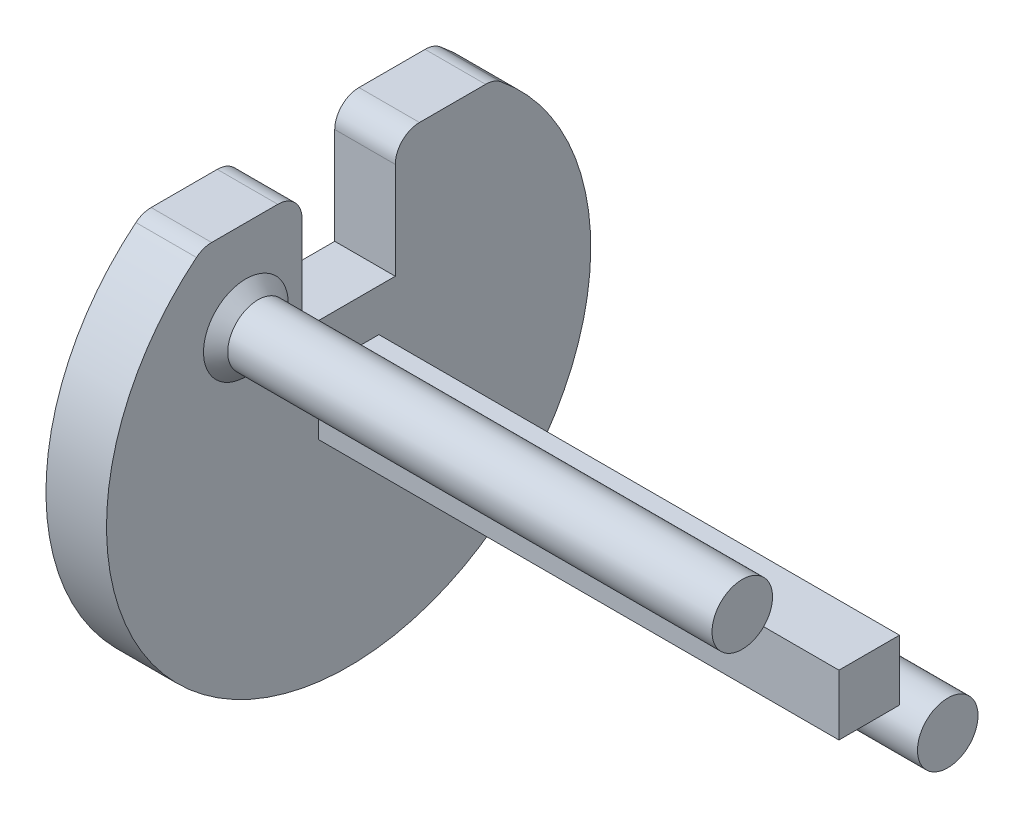
ISO-10303-21;
HEADER;
FILE_DESCRIPTION(('STEP AP214'),'2;1');
FILE_NAME('part.step','',(''),(''),'','','');
FILE_SCHEMA(('AUTOMOTIVE_DESIGN { 1 0 10303 214 1 1 1 1 }'));
ENDSEC;
DATA;
#1=APPLICATION_CONTEXT('core data for automotive mechanical design processes');
#2=APPLICATION_PROTOCOL_DEFINITION('international standard','automotive_design',2000,#1);
#3=PRODUCT_CONTEXT('',#1,'mechanical');
#4=PRODUCT('Part','Part','',(#3));
#5=PRODUCT_RELATED_PRODUCT_CATEGORY('part','',(#4));
#6=PRODUCT_DEFINITION_FORMATION('','',#4);
#7=PRODUCT_DEFINITION_CONTEXT('part definition',#1,'design');
#8=PRODUCT_DEFINITION('design','',#6,#7);
#9=PRODUCT_DEFINITION_SHAPE('','',#8);
#10=(LENGTH_UNIT() NAMED_UNIT(*) SI_UNIT(.MILLI.,.METRE.));
#11=(NAMED_UNIT(*) PLANE_ANGLE_UNIT() SI_UNIT($,.RADIAN.));
#12=(NAMED_UNIT(*) SI_UNIT($,.STERADIAN.) SOLID_ANGLE_UNIT());
#13=UNCERTAINTY_MEASURE_WITH_UNIT(LENGTH_MEASURE(1.E-05),#10,'distance_accuracy_value','');
#14=(GEOMETRIC_REPRESENTATION_CONTEXT(3) GLOBAL_UNCERTAINTY_ASSIGNED_CONTEXT((#13)) GLOBAL_UNIT_ASSIGNED_CONTEXT((#10,
#11,#12)) REPRESENTATION_CONTEXT('',''));
#15=CARTESIAN_POINT('',(0.,0.,0.));
#16=DIRECTION('',(0.,0.,1.));
#17=DIRECTION('',(1.,0.,0.));
#18=AXIS2_PLACEMENT_3D('',#15,#16,#17);
#19=CARTESIAN_POINT('',(5.,0.,0.));
#20=DIRECTION('',(1.,0.,0.));
#21=DIRECTION('',(0.,0.,-1.));
#22=AXIS2_PLACEMENT_3D('',#19,#20,#21);
#23=PLANE('',#22);
#24=CARTESIAN_POINT('',(5.,-8.48528137423855,-8.48528137423859));
#25=DIRECTION('',(1.,0.,0.));
#26=DIRECTION('',(0.,0.,-1.));
#27=AXIS2_PLACEMENT_3D('',#24,#25,#26);
#28=CIRCLE('',#27,3.49999999999999);
#29=CARTESIAN_POINT('',(5.,-8.48528137423855,-11.9852813742386));
#30=VERTEX_POINT('',#29);
#31=EDGE_CURVE('E53',#30,#30,#28,.F.);
#32=ORIENTED_EDGE('',*,*,#31,.T.);
#33=EDGE_LOOP('',(#32));
#34=FACE_BOUND('',#33,.T.);
#35=CARTESIAN_POINT('',(5.,8.48528137423856,8.48528137423858));
#36=DIRECTION('',(1.,0.,0.));
#37=DIRECTION('',(0.,0.,-1.));
#38=AXIS2_PLACEMENT_3D('',#35,#36,#37);
#39=CIRCLE('',#38,3.49999999999999);
#40=CARTESIAN_POINT('',(5.,8.48528137423856,4.98528137423859));
#41=VERTEX_POINT('',#40);
#42=EDGE_CURVE('E311',#41,#41,#39,.F.);
#43=ORIENTED_EDGE('',*,*,#42,.T.);
#44=EDGE_LOOP('',(#43));
#45=FACE_BOUND('',#44,.T.);
#46=CARTESIAN_POINT('',(5.,0.,0.));
#47=DIRECTION('',(1.,0.,0.));
#48=DIRECTION('',(0.,0.,-1.));
#49=AXIS2_PLACEMENT_3D('',#46,#47,#48);
#50=CIRCLE('',#49,20.);
#51=CARTESIAN_POINT('',(5.,15.5555555555556,12.5707872210942));
#52=VERTEX_POINT('',#51);
#53=CARTESIAN_POINT('',(5.,15.5555555555556,-12.5707872210942));
#54=VERTEX_POINT('',#53);
#55=EDGE_CURVE('E251',#52,#54,#50,.T.);
#56=ORIENTED_EDGE('',*,*,#55,.T.);
#57=CARTESIAN_POINT('',(5.,14.,-11.3137084989848));
#58=DIRECTION('',(1.,0.,0.));
#59=DIRECTION('',(0.,0.,-1.));
#60=AXIS2_PLACEMENT_3D('',#57,#58,#59);
#61=CIRCLE('',#60,2.);
#62=CARTESIAN_POINT('',(5.,16.,-11.3137084989848));
#63=VERTEX_POINT('',#62);
#64=EDGE_CURVE('E274',#54,#63,#61,.T.);
#65=ORIENTED_EDGE('',*,*,#64,.T.);
#66=DIRECTION('',(0.,0.,-1.));
#67=VECTOR('',#66,1.);
#68=CARTESIAN_POINT('',(5.,16.,0.));
#69=LINE('',#68,#67);
#70=CARTESIAN_POINT('',(5.,16.,-5.85234209844043));
#71=VERTEX_POINT('',#70);
#72=EDGE_CURVE('E177',#71,#63,#69,.T.);
#73=ORIENTED_EDGE('',*,*,#72,.F.);
#74=CARTESIAN_POINT('',(5.,14.,-5.85234209844043));
#75=DIRECTION('',(1.,0.,0.));
#76=DIRECTION('',(0.,0.,-1.));
#77=AXIS2_PLACEMENT_3D('',#74,#75,#76);
#78=CIRCLE('',#77,2.);
#79=CARTESIAN_POINT('',(5.,14.,-3.85234209844043));
#80=VERTEX_POINT('',#79);
#81=EDGE_CURVE('E271',#71,#80,#78,.T.);
#82=ORIENTED_EDGE('',*,*,#81,.T.);
#83=DIRECTION('',(0.,1.,0.));
#84=VECTOR('',#83,1.);
#85=CARTESIAN_POINT('',(5.,0.,-3.85234209844043));
#86=LINE('',#85,#84);
#87=CARTESIAN_POINT('',(5.,6.,-3.85234209844043));
#88=VERTEX_POINT('',#87);
#89=EDGE_CURVE('E192',#88,#80,#86,.T.);
#90=ORIENTED_EDGE('',*,*,#89,.F.);
#91=DIRECTION('',(0.,0.,-1.));
#92=VECTOR('',#91,1.);
#93=CARTESIAN_POINT('',(5.,6.,0.));
#94=LINE('',#93,#92);
#95=CARTESIAN_POINT('',(5.,6.,3.85234209844043));
#96=VERTEX_POINT('',#95);
#97=EDGE_CURVE('E189',#96,#88,#94,.T.);
#98=ORIENTED_EDGE('',*,*,#97,.F.);
#99=DIRECTION('',(0.,1.,0.));
#100=VECTOR('',#99,1.);
#101=CARTESIAN_POINT('',(5.,0.,3.85234209844043));
#102=LINE('',#101,#100);
#103=CARTESIAN_POINT('',(5.,14.,3.85234209844043));
#104=VERTEX_POINT('',#103);
#105=EDGE_CURVE('E155',#96,#104,#102,.T.);
#106=ORIENTED_EDGE('',*,*,#105,.T.);
#107=CARTESIAN_POINT('',(5.,14.,5.85234209844043));
#108=DIRECTION('',(1.,0.,0.));
#109=DIRECTION('',(0.,0.,-1.));
#110=AXIS2_PLACEMENT_3D('',#107,#108,#109);
#111=CIRCLE('',#110,2.);
#112=CARTESIAN_POINT('',(5.,16.,5.85234209844043));
#113=VERTEX_POINT('',#112);
#114=EDGE_CURVE('E268',#104,#113,#111,.T.);
#115=ORIENTED_EDGE('',*,*,#114,.T.);
#116=DIRECTION('',(0.,0.,-1.));
#117=VECTOR('',#116,1.);
#118=CARTESIAN_POINT('',(5.,16.,0.));
#119=LINE('',#118,#117);
#120=CARTESIAN_POINT('',(5.,16.,11.3137084989848));
#121=VERTEX_POINT('',#120);
#122=EDGE_CURVE('E184',#121,#113,#119,.T.);
#123=ORIENTED_EDGE('',*,*,#122,.F.);
#124=CARTESIAN_POINT('',(5.,14.,11.3137084989848));
#125=DIRECTION('',(1.,0.,0.));
#126=DIRECTION('',(0.,0.,-1.));
#127=AXIS2_PLACEMENT_3D('',#124,#125,#126);
#128=CIRCLE('',#127,2.);
#129=EDGE_CURVE('E265',#121,#52,#128,.T.);
#130=ORIENTED_EDGE('',*,*,#129,.T.);
#131=EDGE_LOOP('',(#56,#65,#73,#82,#90,#98,#106,#115,#123,#130));
#132=FACE_BOUND('',#131,.T.);
#133=DIRECTION('',(0.,0.,1.));
#134=VECTOR('',#133,1.);
#135=CARTESIAN_POINT('',(5.,2.5,2.5));
#136=LINE('',#135,#134);
#137=CARTESIAN_POINT('',(5.,2.5,-2.5));
#138=VERTEX_POINT('',#137);
#139=CARTESIAN_POINT('',(5.,2.5,2.5));
#140=VERTEX_POINT('',#139);
#141=EDGE_CURVE('E228',#138,#140,#136,.T.);
#142=ORIENTED_EDGE('',*,*,#141,.F.);
#143=DIRECTION('',(0.,1.,0.));
#144=VECTOR('',#143,1.);
#145=CARTESIAN_POINT('',(5.,-2.5,-2.5));
#146=LINE('',#145,#144);
#147=CARTESIAN_POINT('',(5.,-2.5,-2.5));
#148=VERTEX_POINT('',#147);
#149=EDGE_CURVE('E209',#148,#138,#146,.T.);
#150=ORIENTED_EDGE('',*,*,#149,.F.);
#151=DIRECTION('',(0.,0.,-1.));
#152=VECTOR('',#151,1.);
#153=CARTESIAN_POINT('',(5.,-2.5,2.5));
#154=LINE('',#153,#152);
#155=CARTESIAN_POINT('',(5.,-2.5,2.5));
#156=VERTEX_POINT('',#155);
#157=EDGE_CURVE('E215',#156,#148,#154,.T.);
#158=ORIENTED_EDGE('',*,*,#157,.F.);
#159=DIRECTION('',(0.,-1.,0.));
#160=VECTOR('',#159,1.);
#161=CARTESIAN_POINT('',(5.,-2.5,2.5));
#162=LINE('',#161,#160);
#163=EDGE_CURVE('E231',#140,#156,#162,.T.);
#164=ORIENTED_EDGE('',*,*,#163,.F.);
#165=EDGE_LOOP('',(#142,#150,#158,#164));
#166=FACE_BOUND('',#165,.T.);
#167=ADVANCED_FACE('F43',(#34,#45,#132,#166),#23,.T.);
#168=CARTESIAN_POINT('',(5.,0.,0.));
#169=DIRECTION('',(-1.,0.,0.));
#170=DIRECTION('',(0.,0.,1.));
#171=AXIS2_PLACEMENT_3D('',#168,#169,#170);
#172=CYLINDRICAL_SURFACE('',#171,20.);
#173=CARTESIAN_POINT('',(0.,0.,0.));
#174=DIRECTION('',(1.,0.,0.));
#175=DIRECTION('',(0.,0.,-1.));
#176=AXIS2_PLACEMENT_3D('',#173,#174,#175);
#177=CIRCLE('',#176,20.);
#178=CARTESIAN_POINT('',(0.,15.5555555555556,12.5707872210942));
#179=VERTEX_POINT('',#178);
#180=CARTESIAN_POINT('',(0.,15.5555555555556,-12.5707872210942));
#181=VERTEX_POINT('',#180);
#182=EDGE_CURVE('E250',#179,#181,#177,.T.);
#183=ORIENTED_EDGE('',*,*,#182,.T.);
#184=DIRECTION('',(-1.,0.,0.));
#185=VECTOR('',#184,1.);
#186=CARTESIAN_POINT('',(5.,15.5555555555556,-12.5707872210942));
#187=LINE('',#186,#185);
#188=EDGE_CURVE('E261',#181,#54,#187,.F.);
#189=ORIENTED_EDGE('',*,*,#188,.T.);
#190=ORIENTED_EDGE('',*,*,#55,.F.);
#191=DIRECTION('',(-1.,0.,0.));
#192=VECTOR('',#191,1.);
#193=CARTESIAN_POINT('',(5.,15.5555555555556,12.5707872210942));
#194=LINE('',#193,#192);
#195=EDGE_CURVE('E255',#52,#179,#194,.T.);
#196=ORIENTED_EDGE('',*,*,#195,.T.);
#197=EDGE_LOOP('',(#183,#189,#190,#196));
#198=FACE_BOUND('',#197,.T.);
#199=ADVANCED_FACE('F345',(#198),#172,.T.);
#200=CARTESIAN_POINT('',(0.,0.,0.));
#201=DIRECTION('',(1.,0.,0.));
#202=DIRECTION('',(0.,0.,-1.));
#203=AXIS2_PLACEMENT_3D('',#200,#201,#202);
#204=PLANE('',#203);
#205=DIRECTION('',(0.,0.,-1.));
#206=VECTOR('',#205,1.);
#207=CARTESIAN_POINT('',(0.,16.,0.));
#208=LINE('',#207,#206);
#209=CARTESIAN_POINT('',(0.,16.,-5.85234209844043));
#210=VERTEX_POINT('',#209);
#211=CARTESIAN_POINT('',(0.,16.,-11.3137084989848));
#212=VERTEX_POINT('',#211);
#213=EDGE_CURVE('E161',#210,#212,#208,.T.);
#214=ORIENTED_EDGE('',*,*,#213,.T.);
#215=CARTESIAN_POINT('',(0.,14.,-11.3137084989848));
#216=DIRECTION('',(1.,0.,0.));
#217=DIRECTION('',(0.,0.,-1.));
#218=AXIS2_PLACEMENT_3D('',#215,#216,#217);
#219=CIRCLE('',#218,2.);
#220=EDGE_CURVE('E292',#212,#181,#219,.F.);
#221=ORIENTED_EDGE('',*,*,#220,.T.);
#222=ORIENTED_EDGE('',*,*,#182,.F.);
#223=CARTESIAN_POINT('',(0.,14.,11.3137084989848));
#224=DIRECTION('',(1.,0.,0.));
#225=DIRECTION('',(0.,0.,-1.));
#226=AXIS2_PLACEMENT_3D('',#223,#224,#225);
#227=CIRCLE('',#226,2.);
#228=CARTESIAN_POINT('',(0.,16.,11.3137084989848));
#229=VERTEX_POINT('',#228);
#230=EDGE_CURVE('E284',#179,#229,#227,.F.);
#231=ORIENTED_EDGE('',*,*,#230,.T.);
#232=DIRECTION('',(0.,0.,-1.));
#233=VECTOR('',#232,1.);
#234=CARTESIAN_POINT('',(0.,16.,0.));
#235=LINE('',#234,#233);
#236=CARTESIAN_POINT('',(0.,16.,5.85234209844043));
#237=VERTEX_POINT('',#236);
#238=EDGE_CURVE('E174',#229,#237,#235,.T.);
#239=ORIENTED_EDGE('',*,*,#238,.T.);
#240=CARTESIAN_POINT('',(0.,14.,5.85234209844043));
#241=DIRECTION('',(1.,0.,0.));
#242=DIRECTION('',(0.,0.,-1.));
#243=AXIS2_PLACEMENT_3D('',#240,#241,#242);
#244=CIRCLE('',#243,2.);
#245=CARTESIAN_POINT('',(0.,14.,3.85234209844043));
#246=VERTEX_POINT('',#245);
#247=EDGE_CURVE('E60',#237,#246,#244,.F.);
#248=ORIENTED_EDGE('',*,*,#247,.T.);
#249=DIRECTION('',(0.,1.,0.));
#250=VECTOR('',#249,1.);
#251=CARTESIAN_POINT('',(0.,0.,3.85234209844043));
#252=LINE('',#251,#250);
#253=CARTESIAN_POINT('',(0.,6.,3.85234209844043));
#254=VERTEX_POINT('',#253);
#255=EDGE_CURVE('E152',#254,#246,#252,.T.);
#256=ORIENTED_EDGE('',*,*,#255,.F.);
#257=DIRECTION('',(0.,0.,-1.));
#258=VECTOR('',#257,1.);
#259=CARTESIAN_POINT('',(0.,6.,0.));
#260=LINE('',#259,#258);
#261=CARTESIAN_POINT('',(0.,6.,-3.85234209844043));
#262=VERTEX_POINT('',#261);
#263=EDGE_CURVE('E164',#254,#262,#260,.T.);
#264=ORIENTED_EDGE('',*,*,#263,.T.);
#265=DIRECTION('',(0.,1.,0.));
#266=VECTOR('',#265,1.);
#267=CARTESIAN_POINT('',(0.,0.,-3.85234209844043));
#268=LINE('',#267,#266);
#269=CARTESIAN_POINT('',(0.,14.,-3.85234209844043));
#270=VERTEX_POINT('',#269);
#271=EDGE_CURVE('E169',#262,#270,#268,.T.);
#272=ORIENTED_EDGE('',*,*,#271,.T.);
#273=CARTESIAN_POINT('',(0.,14.,-5.85234209844043));
#274=DIRECTION('',(1.,0.,0.));
#275=DIRECTION('',(0.,0.,-1.));
#276=AXIS2_PLACEMENT_3D('',#273,#274,#275);
#277=CIRCLE('',#276,2.);
#278=EDGE_CURVE('E289',#270,#210,#277,.F.);
#279=ORIENTED_EDGE('',*,*,#278,.T.);
#280=EDGE_LOOP('',(#214,#221,#222,#231,#239,#248,#256,#264,#272,#279));
#281=FACE_BOUND('',#280,.T.);
#282=ADVANCED_FACE('F172',(#281),#204,.F.);
#283=CARTESIAN_POINT('',(48.,-2.5,-2.5));
#284=DIRECTION('',(0.,0.,1.));
#285=DIRECTION('',(1.,0.,0.));
#286=AXIS2_PLACEMENT_3D('',#283,#284,#285);
#287=PLANE('',#286);
#288=ORIENTED_EDGE('',*,*,#149,.T.);
#289=DIRECTION('',(-1.,0.,0.));
#290=VECTOR('',#289,1.);
#291=CARTESIAN_POINT('',(48.,2.5,-2.5));
#292=LINE('',#291,#290);
#293=CARTESIAN_POINT('',(48.,2.5,-2.5));
#294=VERTEX_POINT('',#293);
#295=EDGE_CURVE('E247',#294,#138,#292,.T.);
#296=ORIENTED_EDGE('',*,*,#295,.F.);
#297=DIRECTION('',(0.,1.,0.));
#298=VECTOR('',#297,1.);
#299=CARTESIAN_POINT('',(48.,-2.5,-2.5));
#300=LINE('',#299,#298);
#301=CARTESIAN_POINT('',(48.,-2.5,-2.5));
#302=VERTEX_POINT('',#301);
#303=EDGE_CURVE('E210',#302,#294,#300,.T.);
#304=ORIENTED_EDGE('',*,*,#303,.F.);
#305=DIRECTION('',(-1.,0.,0.));
#306=VECTOR('',#305,1.);
#307=CARTESIAN_POINT('',(48.,-2.5,-2.5));
#308=LINE('',#307,#306);
#309=EDGE_CURVE('E224',#302,#148,#308,.T.);
#310=ORIENTED_EDGE('',*,*,#309,.T.);
#311=EDGE_LOOP('',(#288,#296,#304,#310));
#312=FACE_BOUND('',#311,.T.);
#313=ADVANCED_FACE('F356',(#312),#287,.F.);
#314=CARTESIAN_POINT('',(48.,2.5,2.5));
#315=DIRECTION('',(0.,-1.,0.));
#316=DIRECTION('',(0.,0.,-1.));
#317=AXIS2_PLACEMENT_3D('',#314,#315,#316);
#318=PLANE('',#317);
#319=ORIENTED_EDGE('',*,*,#141,.T.);
#320=DIRECTION('',(-1.,0.,0.));
#321=VECTOR('',#320,1.);
#322=CARTESIAN_POINT('',(48.,2.5,2.5));
#323=LINE('',#322,#321);
#324=CARTESIAN_POINT('',(48.,2.5,2.5));
#325=VERTEX_POINT('',#324);
#326=EDGE_CURVE('E243',#325,#140,#323,.T.);
#327=ORIENTED_EDGE('',*,*,#326,.F.);
#328=DIRECTION('',(0.,0.,1.));
#329=VECTOR('',#328,1.);
#330=CARTESIAN_POINT('',(48.,2.5,2.5));
#331=LINE('',#330,#329);
#332=EDGE_CURVE('E214',#294,#325,#331,.T.);
#333=ORIENTED_EDGE('',*,*,#332,.F.);
#334=ORIENTED_EDGE('',*,*,#295,.T.);
#335=EDGE_LOOP('',(#319,#327,#333,#334));
#336=FACE_BOUND('',#335,.T.);
#337=ADVANCED_FACE('F472',(#336),#318,.F.);
#338=CARTESIAN_POINT('',(48.,-2.5,2.5));
#339=DIRECTION('',(0.,0.,-1.));
#340=DIRECTION('',(-1.,0.,0.));
#341=AXIS2_PLACEMENT_3D('',#338,#339,#340);
#342=PLANE('',#341);
#343=ORIENTED_EDGE('',*,*,#163,.T.);
#344=DIRECTION('',(-1.,0.,0.));
#345=VECTOR('',#344,1.);
#346=CARTESIAN_POINT('',(48.,-2.5,2.5));
#347=LINE('',#346,#345);
#348=CARTESIAN_POINT('',(48.,-2.5,2.5));
#349=VERTEX_POINT('',#348);
#350=EDGE_CURVE('E240',#349,#156,#347,.T.);
#351=ORIENTED_EDGE('',*,*,#350,.F.);
#352=DIRECTION('',(0.,-1.,0.));
#353=VECTOR('',#352,1.);
#354=CARTESIAN_POINT('',(48.,-2.5,2.5));
#355=LINE('',#354,#353);
#356=EDGE_CURVE('E218',#325,#349,#355,.T.);
#357=ORIENTED_EDGE('',*,*,#356,.F.);
#358=ORIENTED_EDGE('',*,*,#326,.T.);
#359=EDGE_LOOP('',(#343,#351,#357,#358));
#360=FACE_BOUND('',#359,.T.);
#361=ADVANCED_FACE('F469',(#360),#342,.F.);
#362=CARTESIAN_POINT('',(48.,-2.5,2.5));
#363=DIRECTION('',(0.,1.,0.));
#364=DIRECTION('',(0.,0.,1.));
#365=AXIS2_PLACEMENT_3D('',#362,#363,#364);
#366=PLANE('',#365);
#367=ORIENTED_EDGE('',*,*,#157,.T.);
#368=ORIENTED_EDGE('',*,*,#309,.F.);
#369=DIRECTION('',(0.,0.,-1.));
#370=VECTOR('',#369,1.);
#371=CARTESIAN_POINT('',(48.,-2.5,2.5));
#372=LINE('',#371,#370);
#373=EDGE_CURVE('E221',#349,#302,#372,.T.);
#374=ORIENTED_EDGE('',*,*,#373,.F.);
#375=ORIENTED_EDGE('',*,*,#350,.T.);
#376=EDGE_LOOP('',(#367,#368,#374,#375));
#377=FACE_BOUND('',#376,.T.);
#378=ADVANCED_FACE('F465',(#377),#366,.F.);
#379=CARTESIAN_POINT('',(48.,0.,0.));
#380=DIRECTION('',(-1.,0.,0.));
#381=DIRECTION('',(0.,0.,1.));
#382=AXIS2_PLACEMENT_3D('',#379,#380,#381);
#383=PLANE('',#382);
#384=ORIENTED_EDGE('',*,*,#303,.T.);
#385=ORIENTED_EDGE('',*,*,#332,.T.);
#386=ORIENTED_EDGE('',*,*,#356,.T.);
#387=ORIENTED_EDGE('',*,*,#373,.T.);
#388=EDGE_LOOP('',(#384,#385,#386,#387));
#389=FACE_BOUND('',#388,.T.);
#390=ADVANCED_FACE('F454',(#389),#383,.F.);
#391=CARTESIAN_POINT('',(46.,8.48528137423856,8.48528137423858));
#392=DIRECTION('',(-1.,0.,0.));
#393=DIRECTION('',(0.,0.,1.));
#394=AXIS2_PLACEMENT_3D('',#391,#392,#393);
#395=CYLINDRICAL_SURFACE('',#394,2.5);
#396=CARTESIAN_POINT('',(6.00000000000001,8.48528137423856,8.48528137423858));
#397=DIRECTION('',(1.,0.,0.));
#398=DIRECTION('',(0.,0.,-1.));
#399=AXIS2_PLACEMENT_3D('',#396,#397,#398);
#400=CIRCLE('',#399,2.5);
#401=CARTESIAN_POINT('',(6.00000000000001,8.48528137423856,5.98528137423858));
#402=VERTEX_POINT('',#401);
#403=EDGE_CURVE('E11',#402,#402,#400,.T.);
#404=ORIENTED_EDGE('',*,*,#403,.T.);
#405=EDGE_LOOP('',(#404));
#406=FACE_BOUND('',#405,.T.);
#407=CARTESIAN_POINT('',(46.,8.48528137423856,8.48528137423858));
#408=DIRECTION('',(1.,0.,0.));
#409=DIRECTION('',(0.,0.,-1.));
#410=AXIS2_PLACEMENT_3D('',#407,#408,#409);
#411=CIRCLE('',#410,2.5);
#412=CARTESIAN_POINT('',(46.,8.48528137423856,5.98528137423858));
#413=VERTEX_POINT('',#412);
#414=EDGE_CURVE('E205',#413,#413,#411,.T.);
#415=ORIENTED_EDGE('',*,*,#414,.F.);
#416=EDGE_LOOP('',(#415));
#417=FACE_BOUND('',#416,.T.);
#418=ADVANCED_FACE('F451',(#406,#417),#395,.T.);
#419=CARTESIAN_POINT('',(46.,0.,0.));
#420=DIRECTION('',(1.,0.,0.));
#421=DIRECTION('',(0.,0.,-1.));
#422=AXIS2_PLACEMENT_3D('',#419,#420,#421);
#423=PLANE('',#422);
#424=ORIENTED_EDGE('',*,*,#414,.T.);
#425=EDGE_LOOP('',(#424));
#426=FACE_BOUND('',#425,.T.);
#427=ADVANCED_FACE('F330',(#426),#423,.T.);
#428=CARTESIAN_POINT('',(46.,-8.48528137423855,-8.48528137423859));
#429=DIRECTION('',(-1.,0.,0.));
#430=DIRECTION('',(0.,0.,1.));
#431=AXIS2_PLACEMENT_3D('',#428,#429,#430);
#432=CYLINDRICAL_SURFACE('',#431,2.5);
#433=CARTESIAN_POINT('',(6.00000000000001,-8.48528137423855,-8.48528137423859));
#434=DIRECTION('',(1.,0.,0.));
#435=DIRECTION('',(0.,0.,-1.));
#436=AXIS2_PLACEMENT_3D('',#433,#434,#435);
#437=CIRCLE('',#436,2.5);
#438=CARTESIAN_POINT('',(6.00000000000001,-8.48528137423855,-10.9852813742386));
#439=VERTEX_POINT('',#438);
#440=EDGE_CURVE('E307',#439,#439,#437,.T.);
#441=ORIENTED_EDGE('',*,*,#440,.T.);
#442=EDGE_LOOP('',(#441));
#443=FACE_BOUND('',#442,.T.);
#444=CARTESIAN_POINT('',(46.,-8.48528137423855,-8.48528137423859));
#445=DIRECTION('',(1.,0.,0.));
#446=DIRECTION('',(0.,0.,-1.));
#447=AXIS2_PLACEMENT_3D('',#444,#445,#446);
#448=CIRCLE('',#447,2.5);
#449=CARTESIAN_POINT('',(46.,-8.48528137423855,-10.9852813742386));
#450=VERTEX_POINT('',#449);
#451=EDGE_CURVE('E200',#450,#450,#448,.T.);
#452=ORIENTED_EDGE('',*,*,#451,.F.);
#453=EDGE_LOOP('',(#452));
#454=FACE_BOUND('',#453,.T.);
#455=ADVANCED_FACE('F326',(#443,#454),#432,.T.);
#456=CARTESIAN_POINT('',(46.,0.,0.));
#457=DIRECTION('',(1.,0.,0.));
#458=DIRECTION('',(0.,0.,-1.));
#459=AXIS2_PLACEMENT_3D('',#456,#457,#458);
#460=PLANE('',#459);
#461=ORIENTED_EDGE('',*,*,#451,.T.);
#462=EDGE_LOOP('',(#461));
#463=FACE_BOUND('',#462,.T.);
#464=ADVANCED_FACE('F329',(#463),#460,.T.);
#465=CARTESIAN_POINT('',(0.,16.,0.));
#466=DIRECTION('',(0.,-1.,0.));
#467=DIRECTION('',(0.,0.,-1.));
#468=AXIS2_PLACEMENT_3D('',#465,#466,#467);
#469=PLANE('',#468);
#470=ORIENTED_EDGE('',*,*,#72,.T.);
#471=DIRECTION('',(-1.,0.,0.));
#472=VECTOR('',#471,1.);
#473=CARTESIAN_POINT('',(0.,16.,-11.3137084989848));
#474=LINE('',#473,#472);
#475=EDGE_CURVE('E281',#63,#212,#474,.T.);
#476=ORIENTED_EDGE('',*,*,#475,.T.);
#477=ORIENTED_EDGE('',*,*,#213,.F.);
#478=DIRECTION('',(1.,0.,0.));
#479=VECTOR('',#478,1.);
#480=CARTESIAN_POINT('',(0.,16.,-5.85234209844043));
#481=LINE('',#480,#479);
#482=EDGE_CURVE('E277',#210,#71,#481,.T.);
#483=ORIENTED_EDGE('',*,*,#482,.T.);
#484=EDGE_LOOP('',(#470,#476,#477,#483));
#485=FACE_BOUND('',#484,.T.);
#486=ADVANCED_FACE('F335',(#485),#469,.F.);
#487=CARTESIAN_POINT('',(0.,0.,-3.85234209844043));
#488=DIRECTION('',(0.,0.,-1.));
#489=DIRECTION('',(-1.,0.,0.));
#490=AXIS2_PLACEMENT_3D('',#487,#488,#489);
#491=PLANE('',#490);
#492=ORIENTED_EDGE('',*,*,#89,.T.);
#493=DIRECTION('',(1.,0.,0.));
#494=VECTOR('',#493,1.);
#495=CARTESIAN_POINT('',(0.,14.,-3.85234209844043));
#496=LINE('',#495,#494);
#497=EDGE_CURVE('E295',#80,#270,#496,.F.);
#498=ORIENTED_EDGE('',*,*,#497,.T.);
#499=ORIENTED_EDGE('',*,*,#271,.F.);
#500=DIRECTION('',(1.,0.,0.));
#501=VECTOR('',#500,1.);
#502=CARTESIAN_POINT('',(0.,6.,-3.85234209844043));
#503=LINE('',#502,#501);
#504=EDGE_CURVE('E160',#262,#88,#503,.T.);
#505=ORIENTED_EDGE('',*,*,#504,.T.);
#506=EDGE_LOOP('',(#492,#498,#499,#505));
#507=FACE_BOUND('',#506,.T.);
#508=ADVANCED_FACE('F340',(#507),#491,.F.);
#509=CARTESIAN_POINT('',(0.,6.,0.));
#510=DIRECTION('',(0.,-1.,0.));
#511=DIRECTION('',(0.,0.,-1.));
#512=AXIS2_PLACEMENT_3D('',#509,#510,#511);
#513=PLANE('',#512);
#514=ORIENTED_EDGE('',*,*,#97,.T.);
#515=ORIENTED_EDGE('',*,*,#504,.F.);
#516=ORIENTED_EDGE('',*,*,#263,.F.);
#517=DIRECTION('',(1.,0.,0.));
#518=VECTOR('',#517,1.);
#519=CARTESIAN_POINT('',(0.,6.,3.85234209844043));
#520=LINE('',#519,#518);
#521=EDGE_CURVE('E148',#254,#96,#520,.T.);
#522=ORIENTED_EDGE('',*,*,#521,.T.);
#523=EDGE_LOOP('',(#514,#515,#516,#522));
#524=FACE_BOUND('',#523,.T.);
#525=ADVANCED_FACE('F165',(#524),#513,.F.);
#526=CARTESIAN_POINT('',(0.,0.,3.85234209844043));
#527=DIRECTION('',(0.,0.,-1.));
#528=DIRECTION('',(-1.,0.,0.));
#529=AXIS2_PLACEMENT_3D('',#526,#527,#528);
#530=PLANE('',#529);
#531=ORIENTED_EDGE('',*,*,#255,.T.);
#532=DIRECTION('',(1.,0.,0.));
#533=VECTOR('',#532,1.);
#534=CARTESIAN_POINT('',(5.,14.,3.85234209844043));
#535=LINE('',#534,#533);
#536=EDGE_CURVE('E298',#246,#104,#535,.T.);
#537=ORIENTED_EDGE('',*,*,#536,.T.);
#538=ORIENTED_EDGE('',*,*,#105,.F.);
#539=ORIENTED_EDGE('',*,*,#521,.F.);
#540=EDGE_LOOP('',(#531,#537,#538,#539));
#541=FACE_BOUND('',#540,.T.);
#542=ADVANCED_FACE('F150',(#541),#530,.T.);
#543=CARTESIAN_POINT('',(0.,16.,0.));
#544=DIRECTION('',(0.,-1.,0.));
#545=DIRECTION('',(0.,0.,-1.));
#546=AXIS2_PLACEMENT_3D('',#543,#544,#545);
#547=PLANE('',#546);
#548=ORIENTED_EDGE('',*,*,#122,.T.);
#549=DIRECTION('',(1.,0.,0.));
#550=VECTOR('',#549,1.);
#551=CARTESIAN_POINT('',(0.,16.,5.85234209844043));
#552=LINE('',#551,#550);
#553=EDGE_CURVE('E68',#113,#237,#552,.F.);
#554=ORIENTED_EDGE('',*,*,#553,.T.);
#555=ORIENTED_EDGE('',*,*,#238,.F.);
#556=DIRECTION('',(-1.,0.,0.));
#557=VECTOR('',#556,1.);
#558=CARTESIAN_POINT('',(0.,16.,11.3137084989848));
#559=LINE('',#558,#557);
#560=EDGE_CURVE('E301',#229,#121,#559,.F.);
#561=ORIENTED_EDGE('',*,*,#560,.T.);
#562=EDGE_LOOP('',(#548,#554,#555,#561));
#563=FACE_BOUND('',#562,.T.);
#564=ADVANCED_FACE('F364',(#563),#547,.F.);
#565=CARTESIAN_POINT('',(5.,14.,-11.3137084989848));
#566=DIRECTION('',(-1.,0.,0.));
#567=DIRECTION('',(0.,0.,1.));
#568=AXIS2_PLACEMENT_3D('',#565,#566,#567);
#569=CYLINDRICAL_SURFACE('',#568,2.);
#570=ORIENTED_EDGE('',*,*,#220,.F.);
#571=ORIENTED_EDGE('',*,*,#475,.F.);
#572=ORIENTED_EDGE('',*,*,#64,.F.);
#573=ORIENTED_EDGE('',*,*,#188,.F.);
#574=EDGE_LOOP('',(#570,#571,#572,#573));
#575=FACE_BOUND('',#574,.T.);
#576=ADVANCED_FACE('F360',(#575),#569,.T.);
#577=CARTESIAN_POINT('',(0.,14.,-5.85234209844043));
#578=DIRECTION('',(1.,0.,0.));
#579=DIRECTION('',(0.,0.,-1.));
#580=AXIS2_PLACEMENT_3D('',#577,#578,#579);
#581=CYLINDRICAL_SURFACE('',#580,2.);
#582=ORIENTED_EDGE('',*,*,#278,.F.);
#583=ORIENTED_EDGE('',*,*,#497,.F.);
#584=ORIENTED_EDGE('',*,*,#81,.F.);
#585=ORIENTED_EDGE('',*,*,#482,.F.);
#586=EDGE_LOOP('',(#582,#583,#584,#585));
#587=FACE_BOUND('',#586,.T.);
#588=ADVANCED_FACE('F363',(#587),#581,.T.);
#589=CARTESIAN_POINT('',(0.,14.,5.85234209844043));
#590=DIRECTION('',(-1.,0.,0.));
#591=DIRECTION('',(0.,0.,1.));
#592=AXIS2_PLACEMENT_3D('',#589,#590,#591);
#593=CYLINDRICAL_SURFACE('',#592,2.);
#594=ORIENTED_EDGE('',*,*,#247,.F.);
#595=ORIENTED_EDGE('',*,*,#553,.F.);
#596=ORIENTED_EDGE('',*,*,#114,.F.);
#597=ORIENTED_EDGE('',*,*,#536,.F.);
#598=EDGE_LOOP('',(#594,#595,#596,#597));
#599=FACE_BOUND('',#598,.T.);
#600=ADVANCED_FACE('F368',(#599),#593,.T.);
#601=CARTESIAN_POINT('',(5.,14.,11.3137084989848));
#602=DIRECTION('',(-1.,0.,0.));
#603=DIRECTION('',(0.,0.,1.));
#604=AXIS2_PLACEMENT_3D('',#601,#602,#603);
#605=CYLINDRICAL_SURFACE('',#604,2.);
#606=ORIENTED_EDGE('',*,*,#230,.F.);
#607=ORIENTED_EDGE('',*,*,#195,.F.);
#608=ORIENTED_EDGE('',*,*,#129,.F.);
#609=ORIENTED_EDGE('',*,*,#560,.F.);
#610=EDGE_LOOP('',(#606,#607,#608,#609));
#611=FACE_BOUND('',#610,.T.);
#612=ADVANCED_FACE('F323',(#611),#605,.T.);
#613=CARTESIAN_POINT('',(6.00000000000001,-8.48528137423855,-8.48528137423859));
#614=DIRECTION('',(-1.,0.,0.));
#615=DIRECTION('',(0.,0.,1.));
#616=AXIS2_PLACEMENT_3D('',#613,#614,#615);
#617=CONICAL_SURFACE('',#616,2.5,0.785398163397439);
#618=ORIENTED_EDGE('',*,*,#31,.F.);
#619=EDGE_LOOP('',(#618));
#620=FACE_BOUND('',#619,.T.);
#621=ORIENTED_EDGE('',*,*,#440,.F.);
#622=EDGE_LOOP('',(#621));
#623=FACE_BOUND('',#622,.T.);
#624=ADVANCED_FACE('F320',(#620,#623),#617,.T.);
#625=CARTESIAN_POINT('',(6.00000000000001,8.48528137423856,8.48528137423858));
#626=DIRECTION('',(-1.,0.,0.));
#627=DIRECTION('',(0.,0.,1.));
#628=AXIS2_PLACEMENT_3D('',#625,#626,#627);
#629=CONICAL_SURFACE('',#628,2.5,0.785398163397439);
#630=ORIENTED_EDGE('',*,*,#42,.F.);
#631=EDGE_LOOP('',(#630));
#632=FACE_BOUND('',#631,.T.);
#633=ORIENTED_EDGE('',*,*,#403,.F.);
#634=EDGE_LOOP('',(#633));
#635=FACE_BOUND('',#634,.T.);
#636=ADVANCED_FACE('F46',(#632,#635),#629,.T.);
#637=CLOSED_SHELL('',(#167,#199,#282,#313,#337,#361,#378,#390,#418,#427,#455,#464,#486,#508,
#525,#542,#564,#576,#588,#600,#612,#624,#636));
#638=MANIFOLD_SOLID_BREP('B2',#637);
#639=ADVANCED_BREP_SHAPE_REPRESENTATION('',(#18,#638),#14);
#640=SHAPE_DEFINITION_REPRESENTATION(#9,#639);
ENDSEC;
END-ISO-10303-21;
